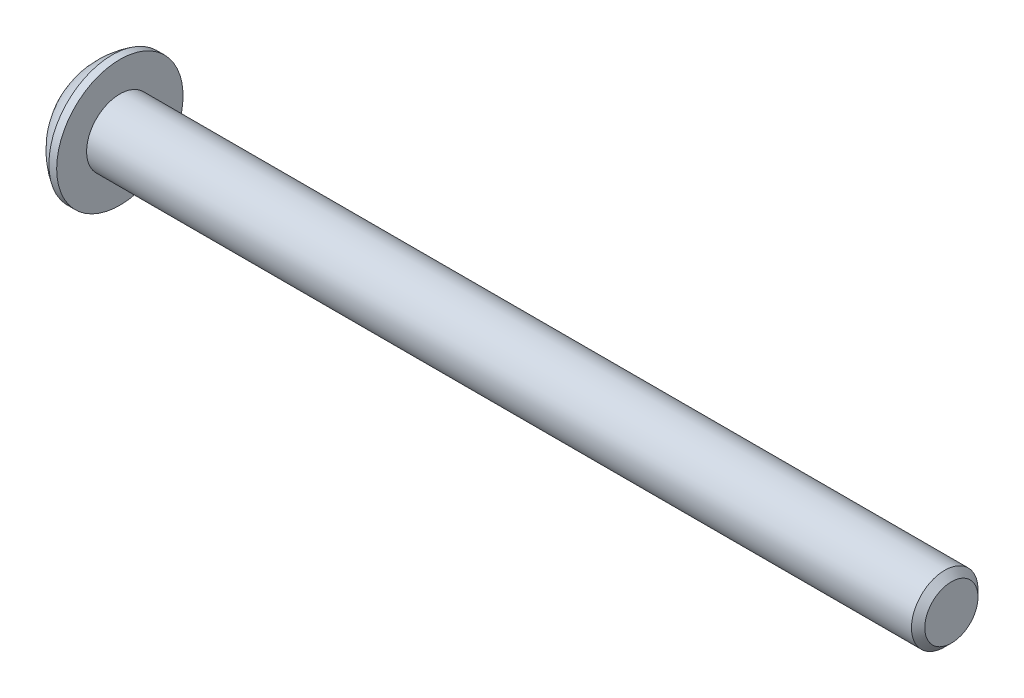
ISO-10303-21;
HEADER;
FILE_DESCRIPTION(('STEP AP214'),'2;1');
FILE_NAME('part.step','',(''),(''),'','','');
FILE_SCHEMA(('AUTOMOTIVE_DESIGN { 1 0 10303 214 1 1 1 1 }'));
ENDSEC;
DATA;
#1=APPLICATION_CONTEXT('core data for automotive mechanical design processes');
#2=APPLICATION_PROTOCOL_DEFINITION('international standard','automotive_design',2000,#1);
#3=PRODUCT_CONTEXT('',#1,'mechanical');
#4=PRODUCT('Part','Part','',(#3));
#5=PRODUCT_RELATED_PRODUCT_CATEGORY('part','',(#4));
#6=PRODUCT_DEFINITION_FORMATION('','',#4);
#7=PRODUCT_DEFINITION_CONTEXT('part definition',#1,'design');
#8=PRODUCT_DEFINITION('design','',#6,#7);
#9=PRODUCT_DEFINITION_SHAPE('','',#8);
#10=(LENGTH_UNIT() NAMED_UNIT(*) SI_UNIT(.MILLI.,.METRE.));
#11=(NAMED_UNIT(*) PLANE_ANGLE_UNIT() SI_UNIT($,.RADIAN.));
#12=(NAMED_UNIT(*) SI_UNIT($,.STERADIAN.) SOLID_ANGLE_UNIT());
#13=UNCERTAINTY_MEASURE_WITH_UNIT(LENGTH_MEASURE(1.E-05),#10,'distance_accuracy_value','');
#14=(GEOMETRIC_REPRESENTATION_CONTEXT(3) GLOBAL_UNCERTAINTY_ASSIGNED_CONTEXT((#13)) GLOBAL_UNIT_ASSIGNED_CONTEXT((#10,
#11,#12)) REPRESENTATION_CONTEXT('',''));
#15=CARTESIAN_POINT('',(0.,0.,0.));
#16=DIRECTION('',(0.,0.,1.));
#17=DIRECTION('',(1.,0.,0.));
#18=AXIS2_PLACEMENT_3D('',#15,#16,#17);
#19=CARTESIAN_POINT('',(0.,1.425,0.));
#20=DIRECTION('',(1.,0.,0.));
#21=DIRECTION('',(0.,0.,-1.));
#22=AXIS2_PLACEMENT_3D('',#19,#20,#21);
#23=PLANE('',#22);
#24=DIRECTION('',(0.,-0.00130636826834642,-0.99999914670061));
#25=VECTOR('',#24,1.);
#26=CARTESIAN_POINT('',(0.,1.000753378772,0.576043408268644));
#27=LINE('',#26,#25);
#28=CARTESIAN_POINT('',(0.,1.000753378772,0.576043408268644));
#29=VERTEX_POINT('',#28);
#30=CARTESIAN_POINT('',(0.,0.999244914629214,-0.578656144805337));
#31=VERTEX_POINT('',#30);
#32=EDGE_CURVE('E135',#29,#31,#27,.T.);
#33=ORIENTED_EDGE('',*,*,#32,.F.);
#34=DIRECTION('',(0.,0.865371480671316,-0.501130921457391));
#35=VECTOR('',#34,1.);
#36=CARTESIAN_POINT('',(0.,0.00150846414278118,1.15469955307398));
#37=LINE('',#36,#35);
#38=CARTESIAN_POINT('',(0.,0.00150846414278118,1.15469955307398));
#39=VERTEX_POINT('',#38);
#40=EDGE_CURVE('E55',#39,#29,#37,.T.);
#41=ORIENTED_EDGE('',*,*,#40,.F.);
#42=DIRECTION('',(0.,0.866677848939663,0.498868225243219));
#43=VECTOR('',#42,1.);
#44=CARTESIAN_POINT('',(0.,-0.999244914629214,0.578656144805337));
#45=LINE('',#44,#43);
#46=CARTESIAN_POINT('',(0.,-0.999244914629214,0.578656144805337));
#47=VERTEX_POINT('',#46);
#48=EDGE_CURVE('E148',#47,#39,#45,.T.);
#49=ORIENTED_EDGE('',*,*,#48,.F.);
#50=DIRECTION('',(0.,0.00130636826834661,0.99999914670061));
#51=VECTOR('',#50,1.);
#52=CARTESIAN_POINT('',(0.,-1.000753378772,-0.576043408268644));
#53=LINE('',#52,#51);
#54=CARTESIAN_POINT('',(0.,-1.000753378772,-0.576043408268644));
#55=VERTEX_POINT('',#54);
#56=EDGE_CURVE('E145',#55,#47,#53,.T.);
#57=ORIENTED_EDGE('',*,*,#56,.F.);
#58=DIRECTION('',(0.,-0.865371480671316,0.501130921457391));
#59=VECTOR('',#58,1.);
#60=CARTESIAN_POINT('',(0.,-0.00150846414278128,-1.15469955307398));
#61=LINE('',#60,#59);
#62=CARTESIAN_POINT('',(0.,-0.00150846414278128,-1.15469955307398));
#63=VERTEX_POINT('',#62);
#64=EDGE_CURVE('E103',#63,#55,#61,.T.);
#65=ORIENTED_EDGE('',*,*,#64,.F.);
#66=DIRECTION('',(0.,-0.866677848939663,-0.498868225243219));
#67=VECTOR('',#66,1.);
#68=CARTESIAN_POINT('',(0.,0.999244914629214,-0.578656144805337));
#69=LINE('',#68,#67);
#70=EDGE_CURVE('E139',#31,#63,#69,.T.);
#71=ORIENTED_EDGE('',*,*,#70,.F.);
#72=EDGE_LOOP('',(#33,#41,#49,#57,#65,#71));
#73=FACE_BOUND('',#72,.T.);
#74=CARTESIAN_POINT('',(0.,0.,0.));
#75=DIRECTION('',(-1.,0.,0.));
#76=DIRECTION('',(0.,0.,1.));
#77=AXIS2_PLACEMENT_3D('',#74,#75,#76);
#78=CIRCLE('',#77,1.425);
#79=CARTESIAN_POINT('',(0.,0.,1.425));
#80=VERTEX_POINT('',#79);
#81=EDGE_CURVE('E154',#80,#80,#78,.T.);
#82=ORIENTED_EDGE('',*,*,#81,.T.);
#83=EDGE_LOOP('',(#82));
#84=FACE_BOUND('',#83,.T.);
#85=ADVANCED_FACE('F39',(#73,#84),#23,.F.);
#86=CARTESIAN_POINT('',(39.15,0.,0.));
#87=DIRECTION('',(-1.,0.,0.));
#88=DIRECTION('',(0.,0.,1.));
#89=AXIS2_PLACEMENT_3D('',#86,#87,#88);
#90=PLANE('',#89);
#91=CARTESIAN_POINT('',(39.15,0.,0.));
#92=DIRECTION('',(-1.,0.,0.));
#93=DIRECTION('',(0.,0.,1.));
#94=AXIS2_PLACEMENT_3D('',#91,#92,#93);
#95=CIRCLE('',#94,1.20000000000001);
#96=CARTESIAN_POINT('',(39.15,0.,1.20000000000001));
#97=VERTEX_POINT('',#96);
#98=EDGE_CURVE('E11',#97,#97,#95,.F.);
#99=ORIENTED_EDGE('',*,*,#98,.T.);
#100=EDGE_LOOP('',(#99));
#101=FACE_BOUND('',#100,.T.);
#102=ADVANCED_FACE('F200',(#101),#90,.F.);
#103=CARTESIAN_POINT('',(0.,0.,0.));
#104=DIRECTION('',(-1.,0.,0.));
#105=DIRECTION('',(0.,0.,1.));
#106=AXIS2_PLACEMENT_3D('',#103,#104,#105);
#107=CYLINDRICAL_SURFACE('',#106,1.5);
#108=CARTESIAN_POINT('',(38.85,0.,0.));
#109=DIRECTION('',(-1.,0.,0.));
#110=DIRECTION('',(0.,0.,1.));
#111=AXIS2_PLACEMENT_3D('',#108,#109,#110);
#112=CIRCLE('',#111,1.5);
#113=CARTESIAN_POINT('',(38.85,0.,1.5));
#114=VERTEX_POINT('',#113);
#115=EDGE_CURVE('E48',#114,#114,#112,.T.);
#116=ORIENTED_EDGE('',*,*,#115,.T.);
#117=EDGE_LOOP('',(#116));
#118=FACE_BOUND('',#117,.T.);
#119=CARTESIAN_POINT('',(1.65,0.,0.));
#120=DIRECTION('',(-1.,0.,0.));
#121=DIRECTION('',(0.,0.,1.));
#122=AXIS2_PLACEMENT_3D('',#119,#120,#121);
#123=CIRCLE('',#122,1.5);
#124=CARTESIAN_POINT('',(1.65,0.,1.5));
#125=VERTEX_POINT('',#124);
#126=EDGE_CURVE('E175',#125,#125,#123,.T.);
#127=ORIENTED_EDGE('',*,*,#126,.F.);
#128=EDGE_LOOP('',(#127));
#129=FACE_BOUND('',#128,.T.);
#130=ADVANCED_FACE('F182',(#118,#129),#107,.T.);
#131=CARTESIAN_POINT('',(1.65,1.5,0.));
#132=DIRECTION('',(-1.,0.,0.));
#133=DIRECTION('',(0.,0.,1.));
#134=AXIS2_PLACEMENT_3D('',#131,#132,#133);
#135=PLANE('',#134);
#136=CARTESIAN_POINT('',(1.65,0.,0.));
#137=DIRECTION('',(-1.,0.,0.));
#138=DIRECTION('',(0.,0.,1.));
#139=AXIS2_PLACEMENT_3D('',#136,#137,#138);
#140=CIRCLE('',#139,2.85);
#141=CARTESIAN_POINT('',(1.65,0.,2.85));
#142=VERTEX_POINT('',#141);
#143=EDGE_CURVE('E171',#142,#142,#140,.T.);
#144=ORIENTED_EDGE('',*,*,#143,.F.);
#145=EDGE_LOOP('',(#144));
#146=FACE_BOUND('',#145,.T.);
#147=ORIENTED_EDGE('',*,*,#126,.T.);
#148=EDGE_LOOP('',(#147));
#149=FACE_BOUND('',#148,.T.);
#150=ADVANCED_FACE('F212',(#146,#149),#135,.F.);
#151=CARTESIAN_POINT('',(0.,0.,0.));
#152=DIRECTION('',(-1.,0.,0.));
#153=DIRECTION('',(0.,0.,1.));
#154=AXIS2_PLACEMENT_3D('',#151,#152,#153);
#155=CYLINDRICAL_SURFACE('',#154,2.85);
#156=CARTESIAN_POINT('',(1.3,0.,0.));
#157=DIRECTION('',(-1.,0.,0.));
#158=DIRECTION('',(0.,0.,1.));
#159=AXIS2_PLACEMENT_3D('',#156,#157,#158);
#160=CIRCLE('',#159,2.85);
#161=CARTESIAN_POINT('',(1.3,0.,2.85));
#162=VERTEX_POINT('',#161);
#163=EDGE_CURVE('E167',#162,#162,#160,.T.);
#164=ORIENTED_EDGE('',*,*,#163,.F.);
#165=EDGE_LOOP('',(#164));
#166=FACE_BOUND('',#165,.T.);
#167=ORIENTED_EDGE('',*,*,#143,.T.);
#168=EDGE_LOOP('',(#167));
#169=FACE_BOUND('',#168,.T.);
#170=ADVANCED_FACE('F195',(#166,#169),#155,.T.);
#171=CARTESIAN_POINT('',(3.13557647887669,0.,0.));
#172=DIRECTION('',(-1.,0.,0.));
#173=DIRECTION('',(0.,0.,1.));
#174=AXIS2_PLACEMENT_3D('',#171,#172,#173);
#175=DEGENERATE_TOROIDAL_SURFACE('',#174,0.13004345441382,3.5,.F.);
#176=ORIENTED_EDGE('',*,*,#81,.F.);
#177=EDGE_LOOP('',(#176));
#178=FACE_BOUND('',#177,.T.);
#179=ORIENTED_EDGE('',*,*,#163,.T.);
#180=EDGE_LOOP('',(#179));
#181=FACE_BOUND('',#180,.T.);
#182=ADVANCED_FACE('F187',(#178,#181),#175,.F.);
#183=CARTESIAN_POINT('',(38.85,0.,0.));
#184=DIRECTION('',(-1.,0.,0.));
#185=DIRECTION('',(0.,0.,1.));
#186=AXIS2_PLACEMENT_3D('',#183,#184,#185);
#187=CONICAL_SURFACE('',#186,1.5,0.785398163397453);
#188=ORIENTED_EDGE('',*,*,#98,.F.);
#189=EDGE_LOOP('',(#188));
#190=FACE_BOUND('',#189,.T.);
#191=ORIENTED_EDGE('',*,*,#115,.F.);
#192=EDGE_LOOP('',(#191));
#193=FACE_BOUND('',#192,.T.);
#194=ADVANCED_FACE('F41',(#190,#193),#187,.T.);
#195=CARTESIAN_POINT('',(1.,0.00150846414278118,1.15469955307398));
#196=DIRECTION('',(0.,0.501130921457391,0.865371480671316));
#197=DIRECTION('',(0.,-0.865371480671316,0.501130921457391));
#198=AXIS2_PLACEMENT_3D('',#195,#196,#197);
#199=PLANE('',#198);
#200=ORIENTED_EDGE('',*,*,#40,.T.);
#201=DIRECTION('',(-1.,0.,0.));
#202=VECTOR('',#201,1.);
#203=CARTESIAN_POINT('',(1.,1.000753378772,0.576043408268644));
#204=LINE('',#203,#202);
#205=CARTESIAN_POINT('',(1.,1.000753378772,0.576043408268644));
#206=VERTEX_POINT('',#205);
#207=EDGE_CURVE('E85',#206,#29,#204,.T.);
#208=ORIENTED_EDGE('',*,*,#207,.F.);
#209=DIRECTION('',(0.,0.865371480671316,-0.501130921457391));
#210=VECTOR('',#209,1.);
#211=CARTESIAN_POINT('',(1.,0.00150846414278118,1.15469955307398));
#212=LINE('',#211,#210);
#213=CARTESIAN_POINT('',(1.,0.00150846414278118,1.15469955307398));
#214=VERTEX_POINT('',#213);
#215=EDGE_CURVE('E151',#214,#206,#212,.T.);
#216=ORIENTED_EDGE('',*,*,#215,.F.);
#217=DIRECTION('',(-1.,0.,0.));
#218=VECTOR('',#217,1.);
#219=CARTESIAN_POINT('',(1.,0.00150846414278118,1.15469955307398));
#220=LINE('',#219,#218);
#221=EDGE_CURVE('E63',#214,#39,#220,.T.);
#222=ORIENTED_EDGE('',*,*,#221,.T.);
#223=EDGE_LOOP('',(#200,#208,#216,#222));
#224=FACE_BOUND('',#223,.T.);
#225=ADVANCED_FACE('F186',(#224),#199,.F.);
#226=CARTESIAN_POINT('',(1.,-0.999244914629214,0.578656144805337));
#227=DIRECTION('',(0.,-0.498868225243219,0.866677848939663));
#228=DIRECTION('',(0.,-0.866677848939663,-0.498868225243219));
#229=AXIS2_PLACEMENT_3D('',#226,#227,#228);
#230=PLANE('',#229);
#231=ORIENTED_EDGE('',*,*,#48,.T.);
#232=ORIENTED_EDGE('',*,*,#221,.F.);
#233=DIRECTION('',(0.,0.866677848939663,0.498868225243219));
#234=VECTOR('',#233,1.);
#235=CARTESIAN_POINT('',(1.,-0.999244914629214,0.578656144805337));
#236=LINE('',#235,#234);
#237=CARTESIAN_POINT('',(1.,-0.999244914629214,0.578656144805337));
#238=VERTEX_POINT('',#237);
#239=EDGE_CURVE('E117',#238,#214,#236,.T.);
#240=ORIENTED_EDGE('',*,*,#239,.F.);
#241=DIRECTION('',(-1.,0.,0.));
#242=VECTOR('',#241,1.);
#243=CARTESIAN_POINT('',(1.,-0.999244914629214,0.578656144805337));
#244=LINE('',#243,#242);
#245=EDGE_CURVE('E108',#238,#47,#244,.T.);
#246=ORIENTED_EDGE('',*,*,#245,.T.);
#247=EDGE_LOOP('',(#231,#232,#240,#246));
#248=FACE_BOUND('',#247,.T.);
#249=ADVANCED_FACE('F193',(#248),#230,.F.);
#250=CARTESIAN_POINT('',(1.,-1.000753378772,-0.576043408268644));
#251=DIRECTION('',(0.,-0.99999914670061,0.00130636826834661));
#252=DIRECTION('',(0.,-0.00130636826834661,-0.99999914670061));
#253=AXIS2_PLACEMENT_3D('',#250,#251,#252);
#254=PLANE('',#253);
#255=ORIENTED_EDGE('',*,*,#56,.T.);
#256=ORIENTED_EDGE('',*,*,#245,.F.);
#257=DIRECTION('',(0.,0.00130636826834661,0.99999914670061));
#258=VECTOR('',#257,1.);
#259=CARTESIAN_POINT('',(1.,-1.000753378772,-0.576043408268644));
#260=LINE('',#259,#258);
#261=CARTESIAN_POINT('',(1.,-1.000753378772,-0.576043408268644));
#262=VERTEX_POINT('',#261);
#263=EDGE_CURVE('E112',#262,#238,#260,.T.);
#264=ORIENTED_EDGE('',*,*,#263,.F.);
#265=DIRECTION('',(-1.,0.,0.));
#266=VECTOR('',#265,1.);
#267=CARTESIAN_POINT('',(1.,-1.000753378772,-0.576043408268644));
#268=LINE('',#267,#266);
#269=EDGE_CURVE('E96',#262,#55,#268,.T.);
#270=ORIENTED_EDGE('',*,*,#269,.T.);
#271=EDGE_LOOP('',(#255,#256,#264,#270));
#272=FACE_BOUND('',#271,.T.);
#273=ADVANCED_FACE('F113',(#272),#254,.F.);
#274=CARTESIAN_POINT('',(1.,-0.00150846414278128,-1.15469955307398));
#275=DIRECTION('',(0.,-0.501130921457391,-0.865371480671316));
#276=DIRECTION('',(0.,0.865371480671316,-0.501130921457391));
#277=AXIS2_PLACEMENT_3D('',#274,#275,#276);
#278=PLANE('',#277);
#279=ORIENTED_EDGE('',*,*,#64,.T.);
#280=ORIENTED_EDGE('',*,*,#269,.F.);
#281=DIRECTION('',(0.,-0.865371480671316,0.501130921457391));
#282=VECTOR('',#281,1.);
#283=CARTESIAN_POINT('',(1.,-0.00150846414278128,-1.15469955307398));
#284=LINE('',#283,#282);
#285=CARTESIAN_POINT('',(1.,-0.00150846414278128,-1.15469955307398));
#286=VERTEX_POINT('',#285);
#287=EDGE_CURVE('E100',#286,#262,#284,.T.);
#288=ORIENTED_EDGE('',*,*,#287,.F.);
#289=DIRECTION('',(-1.,0.,0.));
#290=VECTOR('',#289,1.);
#291=CARTESIAN_POINT('',(1.,-0.00150846414278128,-1.15469955307398));
#292=LINE('',#291,#290);
#293=EDGE_CURVE('E109',#286,#63,#292,.T.);
#294=ORIENTED_EDGE('',*,*,#293,.T.);
#295=EDGE_LOOP('',(#279,#280,#288,#294));
#296=FACE_BOUND('',#295,.T.);
#297=ADVANCED_FACE('F98',(#296),#278,.F.);
#298=CARTESIAN_POINT('',(1.,0.999244914629214,-0.578656144805337));
#299=DIRECTION('',(0.,0.498868225243219,-0.866677848939663));
#300=DIRECTION('',(0.,0.866677848939663,0.498868225243219));
#301=AXIS2_PLACEMENT_3D('',#298,#299,#300);
#302=PLANE('',#301);
#303=ORIENTED_EDGE('',*,*,#70,.T.);
#304=ORIENTED_EDGE('',*,*,#293,.F.);
#305=DIRECTION('',(0.,-0.866677848939663,-0.498868225243219));
#306=VECTOR('',#305,1.);
#307=CARTESIAN_POINT('',(1.,0.999244914629214,-0.578656144805337));
#308=LINE('',#307,#306);
#309=CARTESIAN_POINT('',(1.,0.999244914629214,-0.578656144805337));
#310=VERTEX_POINT('',#309);
#311=EDGE_CURVE('E123',#310,#286,#308,.T.);
#312=ORIENTED_EDGE('',*,*,#311,.F.);
#313=DIRECTION('',(-1.,0.,0.));
#314=VECTOR('',#313,1.);
#315=CARTESIAN_POINT('',(1.,0.999244914629214,-0.578656144805337));
#316=LINE('',#315,#314);
#317=EDGE_CURVE('E159',#310,#31,#316,.T.);
#318=ORIENTED_EDGE('',*,*,#317,.T.);
#319=EDGE_LOOP('',(#303,#304,#312,#318));
#320=FACE_BOUND('',#319,.T.);
#321=ADVANCED_FACE('F222',(#320),#302,.F.);
#322=CARTESIAN_POINT('',(1.,1.000753378772,0.576043408268644));
#323=DIRECTION('',(0.,0.99999914670061,-0.00130636826834642));
#324=DIRECTION('',(0.,0.00130636826834642,0.99999914670061));
#325=AXIS2_PLACEMENT_3D('',#322,#323,#324);
#326=PLANE('',#325);
#327=ORIENTED_EDGE('',*,*,#32,.T.);
#328=ORIENTED_EDGE('',*,*,#317,.F.);
#329=DIRECTION('',(0.,-0.00130636826834642,-0.99999914670061));
#330=VECTOR('',#329,1.);
#331=CARTESIAN_POINT('',(1.,1.000753378772,0.576043408268644));
#332=LINE('',#331,#330);
#333=EDGE_CURVE('E127',#206,#310,#332,.T.);
#334=ORIENTED_EDGE('',*,*,#333,.F.);
#335=ORIENTED_EDGE('',*,*,#207,.T.);
#336=EDGE_LOOP('',(#327,#328,#334,#335));
#337=FACE_BOUND('',#336,.T.);
#338=ADVANCED_FACE('F219',(#337),#326,.F.);
#339=CARTESIAN_POINT('',(1.,0.,0.));
#340=DIRECTION('',(-1.,0.,0.));
#341=DIRECTION('',(0.,0.,1.));
#342=AXIS2_PLACEMENT_3D('',#339,#340,#341);
#343=PLANE('',#342);
#344=ORIENTED_EDGE('',*,*,#215,.T.);
#345=ORIENTED_EDGE('',*,*,#333,.T.);
#346=ORIENTED_EDGE('',*,*,#311,.T.);
#347=ORIENTED_EDGE('',*,*,#287,.T.);
#348=ORIENTED_EDGE('',*,*,#263,.T.);
#349=ORIENTED_EDGE('',*,*,#239,.T.);
#350=EDGE_LOOP('',(#344,#345,#346,#347,#348,#349));
#351=FACE_BOUND('',#350,.T.);
#352=ADVANCED_FACE('F120',(#351),#343,.T.);
#353=CLOSED_SHELL('',(#85,#102,#130,#150,#170,#182,#194,#225,#249,#273,#297,#321,#338,#352));
#354=MANIFOLD_SOLID_BREP('B2',#353);
#355=ADVANCED_BREP_SHAPE_REPRESENTATION('',(#18,#354),#14);
#356=SHAPE_DEFINITION_REPRESENTATION(#9,#355);
ENDSEC;
END-ISO-10303-21;
